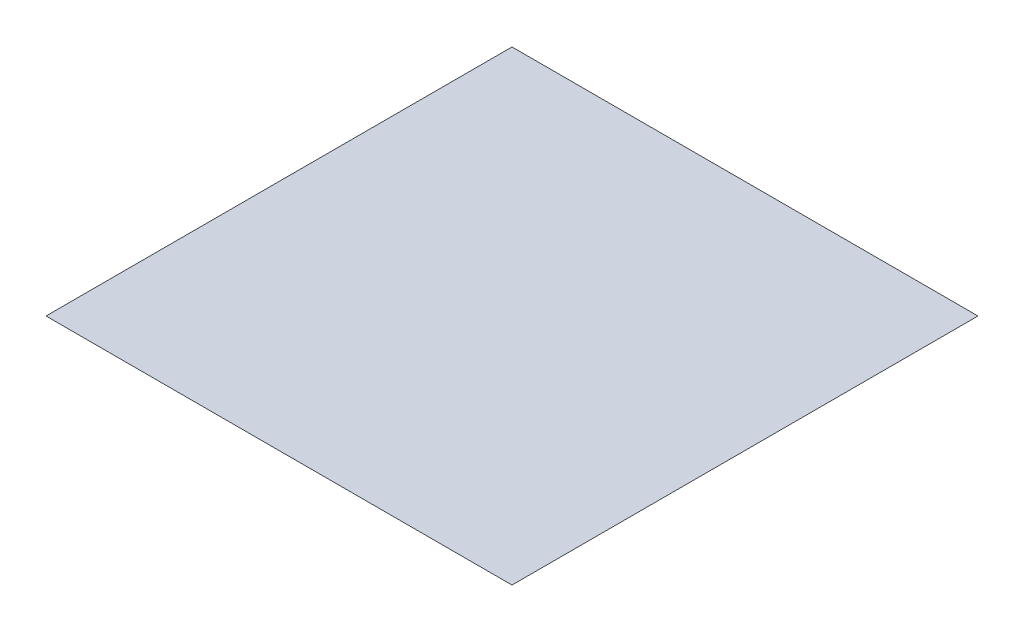
ISO-10303-21;
HEADER;
FILE_DESCRIPTION(('STEP AP214'),'2;1');
FILE_NAME('part.step','',(''),(''),'','','');
FILE_SCHEMA(('AUTOMOTIVE_DESIGN { 1 0 10303 214 1 1 1 1 }'));
ENDSEC;
DATA;
#1=APPLICATION_CONTEXT('core data for automotive mechanical design processes');
#2=APPLICATION_PROTOCOL_DEFINITION('international standard','automotive_design',2000,#1);
#3=PRODUCT_CONTEXT('',#1,'mechanical');
#4=PRODUCT('Part','Part','',(#3));
#5=PRODUCT_RELATED_PRODUCT_CATEGORY('part','',(#4));
#6=PRODUCT_DEFINITION_FORMATION('','',#4);
#7=PRODUCT_DEFINITION_CONTEXT('part definition',#1,'design');
#8=PRODUCT_DEFINITION('design','',#6,#7);
#9=PRODUCT_DEFINITION_SHAPE('','',#8);
#10=(LENGTH_UNIT() NAMED_UNIT(*) SI_UNIT(.MILLI.,.METRE.));
#11=(NAMED_UNIT(*) PLANE_ANGLE_UNIT() SI_UNIT($,.RADIAN.));
#12=(NAMED_UNIT(*) SI_UNIT($,.STERADIAN.) SOLID_ANGLE_UNIT());
#13=UNCERTAINTY_MEASURE_WITH_UNIT(LENGTH_MEASURE(1.E-05),#10,'distance_accuracy_value','');
#14=(GEOMETRIC_REPRESENTATION_CONTEXT(3) GLOBAL_UNCERTAINTY_ASSIGNED_CONTEXT((#13)) GLOBAL_UNIT_ASSIGNED_CONTEXT((#10,
#11,#12)) REPRESENTATION_CONTEXT('',''));
#15=CARTESIAN_POINT('',(0.,0.,0.));
#16=DIRECTION('',(0.,0.,1.));
#17=DIRECTION('',(1.,0.,0.));
#18=AXIS2_PLACEMENT_3D('',#15,#16,#17);
#19=CARTESIAN_POINT('',(-5000.,-4.99999999999999E-05,-5000.));
#20=DIRECTION('',(-1.,0.,0.));
#21=DIRECTION('',(0.,0.,1.));
#22=AXIS2_PLACEMENT_3D('',#19,#20,#21);
#23=PLANE('',#22);
#24=DIRECTION('',(0.,0.,1.));
#25=VECTOR('',#24,1.);
#26=CARTESIAN_POINT('',(-5000.,-4.99999999999999E-05,-5000.));
#27=LINE('',#26,#25);
#28=CARTESIAN_POINT('',(-5000.,-4.99999999999999E-05,-5000.));
#29=VERTEX_POINT('',#28);
#30=CARTESIAN_POINT('',(-5000.,-4.99999999999999E-05,5000.));
#31=VERTEX_POINT('',#30);
#32=EDGE_CURVE('E36',#29,#31,#27,.T.);
#33=ORIENTED_EDGE('',*,*,#32,.T.);
#34=DIRECTION('',(0.,-1.,0.));
#35=VECTOR('',#34,1.);
#36=CARTESIAN_POINT('',(-5000.,-4.99999999999999E-05,5000.));
#37=LINE('',#36,#35);
#38=CARTESIAN_POINT('',(-5000.,5.E-05,5000.));
#39=VERTEX_POINT('',#38);
#40=EDGE_CURVE('E73',#39,#31,#37,.T.);
#41=ORIENTED_EDGE('',*,*,#40,.F.);
#42=DIRECTION('',(0.,0.,1.));
#43=VECTOR('',#42,1.);
#44=CARTESIAN_POINT('',(-5000.,5.E-05,-5000.));
#45=LINE('',#44,#43);
#46=CARTESIAN_POINT('',(-5000.,5.E-05,-5000.));
#47=VERTEX_POINT('',#46);
#48=EDGE_CURVE('E11',#47,#39,#45,.T.);
#49=ORIENTED_EDGE('',*,*,#48,.F.);
#50=DIRECTION('',(0.,-1.,0.));
#51=VECTOR('',#50,1.);
#52=CARTESIAN_POINT('',(-5000.,-4.99999999999999E-05,-5000.));
#53=LINE('',#52,#51);
#54=EDGE_CURVE('E74',#47,#29,#53,.T.);
#55=ORIENTED_EDGE('',*,*,#54,.T.);
#56=EDGE_LOOP('',(#33,#41,#49,#55));
#57=FACE_BOUND('',#56,.T.);
#58=ADVANCED_FACE('F33',(#57),#23,.T.);
#59=CARTESIAN_POINT('',(-5000.,5.E-05,-5000.));
#60=DIRECTION('',(0.,1.,0.));
#61=DIRECTION('',(0.,0.,1.));
#62=AXIS2_PLACEMENT_3D('',#59,#60,#61);
#63=PLANE('',#62);
#64=ORIENTED_EDGE('',*,*,#48,.T.);
#65=DIRECTION('',(-1.,0.,0.));
#66=VECTOR('',#65,1.);
#67=CARTESIAN_POINT('',(-5000.,5.E-05,5000.));
#68=LINE('',#67,#66);
#69=CARTESIAN_POINT('',(5000.,5.E-05,5000.));
#70=VERTEX_POINT('',#69);
#71=EDGE_CURVE('E90',#70,#39,#68,.T.);
#72=ORIENTED_EDGE('',*,*,#71,.F.);
#73=DIRECTION('',(0.,0.,1.));
#74=VECTOR('',#73,1.);
#75=CARTESIAN_POINT('',(5000.,5.E-05,-5000.));
#76=LINE('',#75,#74);
#77=CARTESIAN_POINT('',(5000.,5.E-05,-5000.));
#78=VERTEX_POINT('',#77);
#79=EDGE_CURVE('E41',#78,#70,#76,.T.);
#80=ORIENTED_EDGE('',*,*,#79,.F.);
#81=DIRECTION('',(-1.,0.,0.));
#82=VECTOR('',#81,1.);
#83=CARTESIAN_POINT('',(-5000.,5.E-05,-5000.));
#84=LINE('',#83,#82);
#85=EDGE_CURVE('E79',#78,#47,#84,.T.);
#86=ORIENTED_EDGE('',*,*,#85,.T.);
#87=EDGE_LOOP('',(#64,#72,#80,#86));
#88=FACE_BOUND('',#87,.T.);
#89=ADVANCED_FACE('F105',(#88),#63,.T.);
#90=CARTESIAN_POINT('',(5000.,-5.E-05,-5000.));
#91=DIRECTION('',(1.,0.,0.));
#92=DIRECTION('',(0.,0.,-1.));
#93=AXIS2_PLACEMENT_3D('',#90,#91,#92);
#94=PLANE('',#93);
#95=ORIENTED_EDGE('',*,*,#79,.T.);
#96=DIRECTION('',(0.,1.,0.));
#97=VECTOR('',#96,1.);
#98=CARTESIAN_POINT('',(5000.,-5.E-05,5000.));
#99=LINE('',#98,#97);
#100=CARTESIAN_POINT('',(5000.,-5.E-05,5000.));
#101=VERTEX_POINT('',#100);
#102=EDGE_CURVE('E86',#101,#70,#99,.T.);
#103=ORIENTED_EDGE('',*,*,#102,.F.);
#104=DIRECTION('',(0.,0.,1.));
#105=VECTOR('',#104,1.);
#106=CARTESIAN_POINT('',(5000.,-5.E-05,-5000.));
#107=LINE('',#106,#105);
#108=CARTESIAN_POINT('',(5000.,-5.E-05,-5000.));
#109=VERTEX_POINT('',#108);
#110=EDGE_CURVE('E78',#109,#101,#107,.T.);
#111=ORIENTED_EDGE('',*,*,#110,.F.);
#112=DIRECTION('',(0.,1.,0.));
#113=VECTOR('',#112,1.);
#114=CARTESIAN_POINT('',(5000.,-5.E-05,-5000.));
#115=LINE('',#114,#113);
#116=EDGE_CURVE('E98',#109,#78,#115,.T.);
#117=ORIENTED_EDGE('',*,*,#116,.T.);
#118=EDGE_LOOP('',(#95,#103,#111,#117));
#119=FACE_BOUND('',#118,.T.);
#120=ADVANCED_FACE('F102',(#119),#94,.T.);
#121=CARTESIAN_POINT('',(-5000.,-4.99999999999999E-05,-5000.));
#122=DIRECTION('',(0.,-1.,0.));
#123=DIRECTION('',(1.,0.,0.));
#124=AXIS2_PLACEMENT_3D('',#121,#122,#123);
#125=PLANE('',#124);
#126=ORIENTED_EDGE('',*,*,#110,.T.);
#127=DIRECTION('',(1.,0.,0.));
#128=VECTOR('',#127,1.);
#129=CARTESIAN_POINT('',(-5000.,-4.99999999999999E-05,5000.));
#130=LINE('',#129,#128);
#131=EDGE_CURVE('E81',#31,#101,#130,.T.);
#132=ORIENTED_EDGE('',*,*,#131,.F.);
#133=ORIENTED_EDGE('',*,*,#32,.F.);
#134=DIRECTION('',(1.,0.,0.));
#135=VECTOR('',#134,1.);
#136=CARTESIAN_POINT('',(-5000.,-4.99999999999999E-05,-5000.));
#137=LINE('',#136,#135);
#138=EDGE_CURVE('E96',#29,#109,#137,.T.);
#139=ORIENTED_EDGE('',*,*,#138,.T.);
#140=EDGE_LOOP('',(#126,#132,#133,#139));
#141=FACE_BOUND('',#140,.T.);
#142=ADVANCED_FACE('F82',(#141),#125,.T.);
#143=CARTESIAN_POINT('',(0.,0.,-5000.));
#144=DIRECTION('',(0.,0.,-1.));
#145=DIRECTION('',(-1.,0.,0.));
#146=AXIS2_PLACEMENT_3D('',#143,#144,#145);
#147=PLANE('',#146);
#148=ORIENTED_EDGE('',*,*,#54,.F.);
#149=ORIENTED_EDGE('',*,*,#85,.F.);
#150=ORIENTED_EDGE('',*,*,#116,.F.);
#151=ORIENTED_EDGE('',*,*,#138,.F.);
#152=EDGE_LOOP('',(#148,#149,#150,#151));
#153=FACE_BOUND('',#152,.T.);
#154=ADVANCED_FACE('F107',(#153),#147,.T.);
#155=CARTESIAN_POINT('',(0.,0.,5000.));
#156=DIRECTION('',(0.,0.,-1.));
#157=DIRECTION('',(-1.,0.,0.));
#158=AXIS2_PLACEMENT_3D('',#155,#156,#157);
#159=PLANE('',#158);
#160=ORIENTED_EDGE('',*,*,#40,.T.);
#161=ORIENTED_EDGE('',*,*,#131,.T.);
#162=ORIENTED_EDGE('',*,*,#102,.T.);
#163=ORIENTED_EDGE('',*,*,#71,.T.);
#164=EDGE_LOOP('',(#160,#161,#162,#163));
#165=FACE_BOUND('',#164,.T.);
#166=ADVANCED_FACE('F89',(#165),#159,.F.);
#167=CLOSED_SHELL('',(#58,#89,#120,#142,#154,#166));
#168=MANIFOLD_SOLID_BREP('B2',#167);
#169=ADVANCED_BREP_SHAPE_REPRESENTATION('',(#18,#168),#14);
#170=SHAPE_DEFINITION_REPRESENTATION(#9,#169);
ENDSEC;
END-ISO-10303-21;
